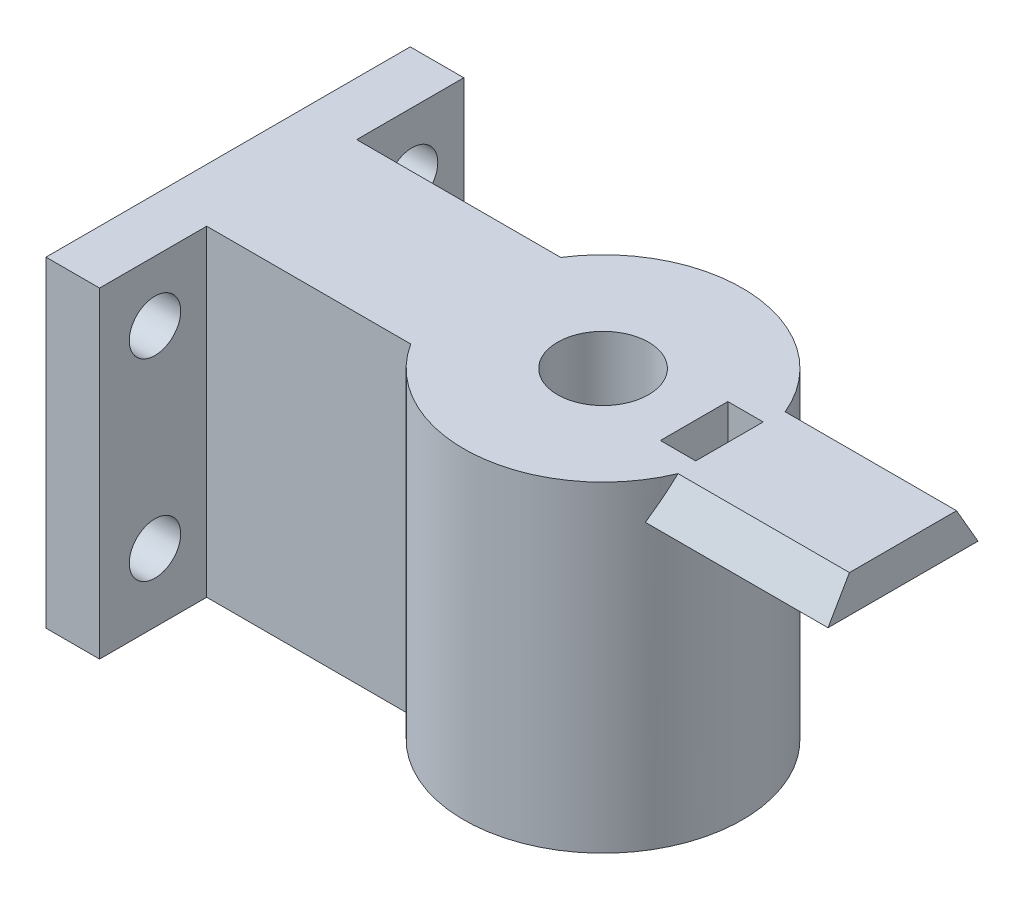
ISO-10303-21;
HEADER;
FILE_DESCRIPTION(('STEP AP214'),'2;1');
FILE_NAME('part.step','',(''),(''),'','','');
FILE_SCHEMA(('AUTOMOTIVE_DESIGN { 1 0 10303 214 1 1 1 1 }'));
ENDSEC;
DATA;
#1=APPLICATION_CONTEXT('core data for automotive mechanical design processes');
#2=APPLICATION_PROTOCOL_DEFINITION('international standard','automotive_design',2000,#1);
#3=PRODUCT_CONTEXT('',#1,'mechanical');
#4=PRODUCT('Part','Part','',(#3));
#5=PRODUCT_RELATED_PRODUCT_CATEGORY('part','',(#4));
#6=PRODUCT_DEFINITION_FORMATION('','',#4);
#7=PRODUCT_DEFINITION_CONTEXT('part definition',#1,'design');
#8=PRODUCT_DEFINITION('design','',#6,#7);
#9=PRODUCT_DEFINITION_SHAPE('','',#8);
#10=(LENGTH_UNIT() NAMED_UNIT(*) SI_UNIT(.MILLI.,.METRE.));
#11=(NAMED_UNIT(*) PLANE_ANGLE_UNIT() SI_UNIT($,.RADIAN.));
#12=(NAMED_UNIT(*) SI_UNIT($,.STERADIAN.) SOLID_ANGLE_UNIT());
#13=UNCERTAINTY_MEASURE_WITH_UNIT(LENGTH_MEASURE(1.E-05),#10,'distance_accuracy_value','');
#14=(GEOMETRIC_REPRESENTATION_CONTEXT(3) GLOBAL_UNCERTAINTY_ASSIGNED_CONTEXT((#13)) GLOBAL_UNIT_ASSIGNED_CONTEXT((#10,
#11,#12)) REPRESENTATION_CONTEXT('',''));
#15=CARTESIAN_POINT('',(0.,0.,0.));
#16=DIRECTION('',(0.,0.,1.));
#17=DIRECTION('',(1.,0.,0.));
#18=AXIS2_PLACEMENT_3D('',#15,#16,#17);
#19=CARTESIAN_POINT('',(35.,30.,0.));
#20=DIRECTION('',(0.,-1.,0.));
#21=DIRECTION('',(0.,0.,-1.));
#22=AXIS2_PLACEMENT_3D('',#19,#20,#21);
#23=PLANE('',#22);
#24=CARTESIAN_POINT('',(35.,30.,0.));
#25=DIRECTION('',(0.,1.,0.));
#26=DIRECTION('',(0.,0.,1.));
#27=AXIS2_PLACEMENT_3D('',#24,#25,#26);
#28=CIRCLE('',#27,4.25000000000001);
#29=CARTESIAN_POINT('',(35.,30.,4.24999999999999));
#30=VERTEX_POINT('',#29);
#31=EDGE_CURVE('E269',#30,#30,#28,.T.);
#32=ORIENTED_EDGE('',*,*,#31,.F.);
#33=EDGE_LOOP('',(#32));
#34=FACE_BOUND('',#33,.T.);
#35=DIRECTION('',(-1.,0.,0.));
#36=VECTOR('',#35,1.);
#37=CARTESIAN_POINT('',(4.99999999999999,30.,-17.));
#38=LINE('',#37,#36);
#39=CARTESIAN_POINT('',(4.99999999999999,30.,-17.));
#40=VERTEX_POINT('',#39);
#41=CARTESIAN_POINT('',(0.,30.,-17.));
#42=VERTEX_POINT('',#41);
#43=EDGE_CURVE('E275',#40,#42,#38,.T.);
#44=ORIENTED_EDGE('',*,*,#43,.T.);
#45=DIRECTION('',(0.,0.,1.));
#46=VECTOR('',#45,1.);
#47=CARTESIAN_POINT('',(0.,30.,-17.));
#48=LINE('',#47,#46);
#49=CARTESIAN_POINT('',(0.,30.,17.));
#50=VERTEX_POINT('',#49);
#51=EDGE_CURVE('E278',#42,#50,#48,.T.);
#52=ORIENTED_EDGE('',*,*,#51,.T.);
#53=DIRECTION('',(1.,0.,0.));
#54=VECTOR('',#53,1.);
#55=CARTESIAN_POINT('',(0.,30.,17.));
#56=LINE('',#55,#54);
#57=CARTESIAN_POINT('',(5.,30.,17.));
#58=VERTEX_POINT('',#57);
#59=EDGE_CURVE('E281',#50,#58,#56,.T.);
#60=ORIENTED_EDGE('',*,*,#59,.T.);
#61=DIRECTION('',(0.,0.,-1.));
#62=VECTOR('',#61,1.);
#63=CARTESIAN_POINT('',(5.,30.,17.));
#64=LINE('',#63,#62);
#65=CARTESIAN_POINT('',(5.,30.,7.));
#66=VERTEX_POINT('',#65);
#67=EDGE_CURVE('E283',#58,#66,#64,.T.);
#68=ORIENTED_EDGE('',*,*,#67,.T.);
#69=DIRECTION('',(1.,0.,0.));
#70=VECTOR('',#69,1.);
#71=CARTESIAN_POINT('',(5.,30.,7.));
#72=LINE('',#71,#70);
#73=CARTESIAN_POINT('',(24.0455488498967,30.,7.));
#74=VERTEX_POINT('',#73);
#75=EDGE_CURVE('E285',#66,#74,#72,.T.);
#76=ORIENTED_EDGE('',*,*,#75,.T.);
#77=CARTESIAN_POINT('',(35.,30.,0.));
#78=DIRECTION('',(0.,1.,0.));
#79=DIRECTION('',(0.,0.,-1.));
#80=AXIS2_PLACEMENT_3D('',#77,#78,#79);
#81=CIRCLE('',#80,13.);
#82=CARTESIAN_POINT('',(47.,30.,5.));
#83=VERTEX_POINT('',#82);
#84=EDGE_CURVE('E288',#74,#83,#81,.T.);
#85=ORIENTED_EDGE('',*,*,#84,.T.);
#86=DIRECTION('',(-1.,0.,0.));
#87=VECTOR('',#86,1.);
#88=CARTESIAN_POINT('',(63.,30.,5.));
#89=LINE('',#88,#87);
#90=CARTESIAN_POINT('',(63.,30.,5.));
#91=VERTEX_POINT('',#90);
#92=EDGE_CURVE('E200',#91,#83,#89,.T.);
#93=ORIENTED_EDGE('',*,*,#92,.F.);
#94=DIRECTION('',(0.,0.,1.));
#95=VECTOR('',#94,1.);
#96=CARTESIAN_POINT('',(63.,30.,5.));
#97=LINE('',#96,#95);
#98=CARTESIAN_POINT('',(63.,30.,-5.));
#99=VERTEX_POINT('',#98);
#100=EDGE_CURVE('E198',#99,#91,#97,.T.);
#101=ORIENTED_EDGE('',*,*,#100,.F.);
#102=DIRECTION('',(-1.,0.,0.));
#103=VECTOR('',#102,1.);
#104=CARTESIAN_POINT('',(63.,30.,-5.));
#105=LINE('',#104,#103);
#106=CARTESIAN_POINT('',(47.,30.,-5.));
#107=VERTEX_POINT('',#106);
#108=EDGE_CURVE('E202',#99,#107,#105,.T.);
#109=ORIENTED_EDGE('',*,*,#108,.T.);
#110=CARTESIAN_POINT('',(24.0455488498967,30.,-7.00000000000002));
#111=VERTEX_POINT('',#110);
#112=EDGE_CURVE('E287',#107,#111,#81,.T.);
#113=ORIENTED_EDGE('',*,*,#112,.T.);
#114=DIRECTION('',(-1.,0.,0.));
#115=VECTOR('',#114,1.);
#116=CARTESIAN_POINT('',(24.0455488498967,30.,-7.00000000000001));
#117=LINE('',#116,#115);
#118=CARTESIAN_POINT('',(5.,30.,-7.));
#119=VERTEX_POINT('',#118);
#120=EDGE_CURVE('E291',#111,#119,#117,.T.);
#121=ORIENTED_EDGE('',*,*,#120,.T.);
#122=DIRECTION('',(0.,0.,-1.));
#123=VECTOR('',#122,1.);
#124=CARTESIAN_POINT('',(5.,30.,-7.));
#125=LINE('',#124,#123);
#126=EDGE_CURVE('E293',#119,#40,#125,.T.);
#127=ORIENTED_EDGE('',*,*,#126,.T.);
#128=EDGE_LOOP('',(#44,#52,#60,#68,#76,#85,#93,#101,#109,#113,#121,#127));
#129=FACE_BOUND('',#128,.T.);
#130=DIRECTION('',(0.,0.,1.));
#131=VECTOR('',#130,1.);
#132=CARTESIAN_POINT('',(43.5,30.,0.));
#133=LINE('',#132,#131);
#134=CARTESIAN_POINT('',(43.5,30.,-3.15));
#135=VERTEX_POINT('',#134);
#136=CARTESIAN_POINT('',(43.5,30.,3.15));
#137=VERTEX_POINT('',#136);
#138=EDGE_CURVE('E12',#135,#137,#133,.T.);
#139=ORIENTED_EDGE('',*,*,#138,.F.);
#140=DIRECTION('',(1.,0.,0.));
#141=VECTOR('',#140,1.);
#142=CARTESIAN_POINT('',(35.,30.,-3.15));
#143=LINE('',#142,#141);
#144=CARTESIAN_POINT('',(46.8,30.,-3.15));
#145=VERTEX_POINT('',#144);
#146=EDGE_CURVE('E49',#135,#145,#143,.T.);
#147=ORIENTED_EDGE('',*,*,#146,.T.);
#148=DIRECTION('',(0.,0.,1.));
#149=VECTOR('',#148,1.);
#150=CARTESIAN_POINT('',(46.8,30.,0.));
#151=LINE('',#150,#149);
#152=CARTESIAN_POINT('',(46.8,30.,3.15));
#153=VERTEX_POINT('',#152);
#154=EDGE_CURVE('E334',#145,#153,#151,.T.);
#155=ORIENTED_EDGE('',*,*,#154,.T.);
#156=DIRECTION('',(-1.,0.,0.));
#157=VECTOR('',#156,1.);
#158=CARTESIAN_POINT('',(35.,30.,3.15));
#159=LINE('',#158,#157);
#160=EDGE_CURVE('E337',#153,#137,#159,.T.);
#161=ORIENTED_EDGE('',*,*,#160,.T.);
#162=EDGE_LOOP('',(#139,#147,#155,#161));
#163=FACE_BOUND('',#162,.T.);
#164=ADVANCED_FACE('F41',(#34,#129,#163),#23,.F.);
#165=CARTESIAN_POINT('',(35.,30.,0.));
#166=DIRECTION('',(0.,-1.,0.));
#167=DIRECTION('',(0.,0.,-1.));
#168=AXIS2_PLACEMENT_3D('',#165,#166,#167);
#169=CYLINDRICAL_SURFACE('',#168,13.);
#170=CARTESIAN_POINT('',(35.,38.6602540378445,0.));
#171=DIRECTION('',(0.,0.499999999999998,0.86602540378444));
#172=DIRECTION('',(0.,-0.86602540378444,0.499999999999998));
#173=AXIS2_PLACEMENT_3D('',#170,#171,#172);
#174=ELLIPSE('',#173,26.0000000000001,13.);
#175=CARTESIAN_POINT('',(45.9544511501033,26.5358983848622,7.));
#176=VERTEX_POINT('',#175);
#177=EDGE_CURVE('E186',#83,#176,#174,.F.);
#178=ORIENTED_EDGE('',*,*,#177,.F.);
#179=ORIENTED_EDGE('',*,*,#84,.F.);
#180=DIRECTION('',(0.,-1.,0.));
#181=VECTOR('',#180,1.);
#182=CARTESIAN_POINT('',(24.0455488498967,30.,7.));
#183=LINE('',#182,#181);
#184=CARTESIAN_POINT('',(24.0455488498967,0.,7.));
#185=VERTEX_POINT('',#184);
#186=EDGE_CURVE('E319',#74,#185,#183,.T.);
#187=ORIENTED_EDGE('',*,*,#186,.T.);
#188=CARTESIAN_POINT('',(35.,0.,0.));
#189=DIRECTION('',(0.,1.,0.));
#190=DIRECTION('',(0.,0.,-1.));
#191=AXIS2_PLACEMENT_3D('',#188,#189,#190);
#192=CIRCLE('',#191,13.);
#193=CARTESIAN_POINT('',(24.0455488498967,0.,-7.00000000000002));
#194=VERTEX_POINT('',#193);
#195=EDGE_CURVE('E306',#185,#194,#192,.T.);
#196=ORIENTED_EDGE('',*,*,#195,.T.);
#197=DIRECTION('',(0.,-1.,0.));
#198=VECTOR('',#197,1.);
#199=CARTESIAN_POINT('',(24.0455488498967,30.,-7.00000000000002));
#200=LINE('',#199,#198);
#201=EDGE_CURVE('E316',#111,#194,#200,.T.);
#202=ORIENTED_EDGE('',*,*,#201,.F.);
#203=ORIENTED_EDGE('',*,*,#112,.F.);
#204=CARTESIAN_POINT('',(35.,38.6602540378444,0.));
#205=DIRECTION('',(0.,0.499999999999997,-0.86602540378444));
#206=DIRECTION('',(0.,-0.86602540378444,-0.499999999999997));
#207=AXIS2_PLACEMENT_3D('',#204,#205,#206);
#208=ELLIPSE('',#207,26.0000000000001,13.);
#209=CARTESIAN_POINT('',(45.9544511501033,26.5358983848622,-7.));
#210=VERTEX_POINT('',#209);
#211=EDGE_CURVE('E64',#210,#107,#208,.F.);
#212=ORIENTED_EDGE('',*,*,#211,.F.);
#213=CARTESIAN_POINT('',(35.,26.5358983848622,0.));
#214=DIRECTION('',(0.,-1.,0.));
#215=DIRECTION('',(0.,0.,-1.));
#216=AXIS2_PLACEMENT_3D('',#213,#214,#215);
#217=CIRCLE('',#216,13.);
#218=EDGE_CURVE('E185',#176,#210,#217,.F.);
#219=ORIENTED_EDGE('',*,*,#218,.F.);
#220=EDGE_LOOP('',(#178,#179,#187,#196,#202,#203,#212,#219));
#221=FACE_BOUND('',#220,.T.);
#222=ADVANCED_FACE('F354',(#221),#169,.T.);
#223=CARTESIAN_POINT('',(35.,30.,0.));
#224=DIRECTION('',(0.,-1.,0.));
#225=DIRECTION('',(0.,0.,-1.));
#226=AXIS2_PLACEMENT_3D('',#223,#224,#225);
#227=CYLINDRICAL_SURFACE('',#226,4.25000000000001);
#228=ORIENTED_EDGE('',*,*,#31,.T.);
#229=EDGE_LOOP('',(#228));
#230=FACE_BOUND('',#229,.T.);
#231=CARTESIAN_POINT('',(35.,15.6,0.));
#232=DIRECTION('',(0.,-1.,0.));
#233=DIRECTION('',(0.,0.,-1.));
#234=AXIS2_PLACEMENT_3D('',#231,#232,#233);
#235=CIRCLE('',#234,4.25000000000001);
#236=CARTESIAN_POINT('',(35.,15.6,-4.25000000000002));
#237=VERTEX_POINT('',#236);
#238=EDGE_CURVE('E254',#237,#237,#235,.T.);
#239=ORIENTED_EDGE('',*,*,#238,.T.);
#240=EDGE_LOOP('',(#239));
#241=FACE_BOUND('',#240,.T.);
#242=ADVANCED_FACE('F360',(#230,#241),#227,.F.);
#243=CARTESIAN_POINT('',(35.,0.,0.));
#244=DIRECTION('',(0.,-1.,0.));
#245=DIRECTION('',(0.,0.,-1.));
#246=AXIS2_PLACEMENT_3D('',#243,#244,#245);
#247=PLANE('',#246);
#248=CARTESIAN_POINT('',(35.,0.,0.));
#249=DIRECTION('',(0.,-1.,0.));
#250=DIRECTION('',(0.,0.,-1.));
#251=AXIS2_PLACEMENT_3D('',#248,#249,#250);
#252=CIRCLE('',#251,11.25);
#253=CARTESIAN_POINT('',(35.,0.,-11.25));
#254=VERTEX_POINT('',#253);
#255=EDGE_CURVE('E263',#254,#254,#252,.T.);
#256=ORIENTED_EDGE('',*,*,#255,.F.);
#257=EDGE_LOOP('',(#256));
#258=FACE_BOUND('',#257,.T.);
#259=DIRECTION('',(-1.,0.,0.));
#260=VECTOR('',#259,1.);
#261=CARTESIAN_POINT('',(4.99999999999999,0.,-17.));
#262=LINE('',#261,#260);
#263=CARTESIAN_POINT('',(4.99999999999999,0.,-17.));
#264=VERTEX_POINT('',#263);
#265=CARTESIAN_POINT('',(0.,0.,-17.));
#266=VERTEX_POINT('',#265);
#267=EDGE_CURVE('E274',#264,#266,#262,.T.);
#268=ORIENTED_EDGE('',*,*,#267,.F.);
#269=DIRECTION('',(0.,0.,-1.));
#270=VECTOR('',#269,1.);
#271=CARTESIAN_POINT('',(5.,0.,-7.));
#272=LINE('',#271,#270);
#273=CARTESIAN_POINT('',(5.,0.,-7.));
#274=VERTEX_POINT('',#273);
#275=EDGE_CURVE('E279',#274,#264,#272,.T.);
#276=ORIENTED_EDGE('',*,*,#275,.F.);
#277=DIRECTION('',(-1.,0.,0.));
#278=VECTOR('',#277,1.);
#279=CARTESIAN_POINT('',(24.0455488498967,0.,-7.00000000000001));
#280=LINE('',#279,#278);
#281=EDGE_CURVE('E308',#194,#274,#280,.T.);
#282=ORIENTED_EDGE('',*,*,#281,.F.);
#283=ORIENTED_EDGE('',*,*,#195,.F.);
#284=DIRECTION('',(1.,0.,0.));
#285=VECTOR('',#284,1.);
#286=CARTESIAN_POINT('',(5.,0.,7.));
#287=LINE('',#286,#285);
#288=CARTESIAN_POINT('',(5.,0.,7.));
#289=VERTEX_POINT('',#288);
#290=EDGE_CURVE('E304',#289,#185,#287,.T.);
#291=ORIENTED_EDGE('',*,*,#290,.F.);
#292=DIRECTION('',(0.,0.,-1.));
#293=VECTOR('',#292,1.);
#294=CARTESIAN_POINT('',(5.,0.,17.));
#295=LINE('',#294,#293);
#296=CARTESIAN_POINT('',(5.,0.,17.));
#297=VERTEX_POINT('',#296);
#298=EDGE_CURVE('E302',#297,#289,#295,.T.);
#299=ORIENTED_EDGE('',*,*,#298,.F.);
#300=DIRECTION('',(1.,0.,0.));
#301=VECTOR('',#300,1.);
#302=CARTESIAN_POINT('',(0.,0.,17.));
#303=LINE('',#302,#301);
#304=CARTESIAN_POINT('',(0.,0.,17.));
#305=VERTEX_POINT('',#304);
#306=EDGE_CURVE('E300',#305,#297,#303,.T.);
#307=ORIENTED_EDGE('',*,*,#306,.F.);
#308=DIRECTION('',(0.,0.,1.));
#309=VECTOR('',#308,1.);
#310=CARTESIAN_POINT('',(0.,0.,-17.));
#311=LINE('',#310,#309);
#312=EDGE_CURVE('E298',#266,#305,#311,.T.);
#313=ORIENTED_EDGE('',*,*,#312,.F.);
#314=EDGE_LOOP('',(#268,#276,#282,#283,#291,#299,#307,#313));
#315=FACE_BOUND('',#314,.T.);
#316=ADVANCED_FACE('F368',(#258,#315),#247,.T.);
#317=CARTESIAN_POINT('',(4.99999999999999,30.,-17.));
#318=DIRECTION('',(0.,0.,1.));
#319=DIRECTION('',(1.,0.,0.));
#320=AXIS2_PLACEMENT_3D('',#317,#318,#319);
#321=PLANE('',#320);
#322=ORIENTED_EDGE('',*,*,#267,.T.);
#323=DIRECTION('',(0.,-1.,0.));
#324=VECTOR('',#323,1.);
#325=CARTESIAN_POINT('',(0.,30.,-17.));
#326=LINE('',#325,#324);
#327=EDGE_CURVE('E331',#42,#266,#326,.T.);
#328=ORIENTED_EDGE('',*,*,#327,.F.);
#329=ORIENTED_EDGE('',*,*,#43,.F.);
#330=DIRECTION('',(0.,-1.,0.));
#331=VECTOR('',#330,1.);
#332=CARTESIAN_POINT('',(4.99999999999999,30.,-17.));
#333=LINE('',#332,#331);
#334=EDGE_CURVE('E295',#40,#264,#333,.T.);
#335=ORIENTED_EDGE('',*,*,#334,.T.);
#336=EDGE_LOOP('',(#322,#328,#329,#335));
#337=FACE_BOUND('',#336,.T.);
#338=ADVANCED_FACE('F43',(#337),#321,.F.);
#339=CARTESIAN_POINT('',(0.,30.,-17.));
#340=DIRECTION('',(1.,0.,0.));
#341=DIRECTION('',(0.,0.,-1.));
#342=AXIS2_PLACEMENT_3D('',#339,#340,#341);
#343=PLANE('',#342);
#344=CARTESIAN_POINT('',(0.,24.3634390627818,11.8281321203426));
#345=DIRECTION('',(1.,0.,0.));
#346=DIRECTION('',(0.,0.,-1.));
#347=AXIS2_PLACEMENT_3D('',#344,#345,#346);
#348=CIRCLE('',#347,2.4);
#349=CARTESIAN_POINT('',(0.,24.3634390627818,9.42813212034262));
#350=VERTEX_POINT('',#349);
#351=EDGE_CURVE('E246',#350,#350,#348,.T.);
#352=ORIENTED_EDGE('',*,*,#351,.T.);
#353=EDGE_LOOP('',(#352));
#354=FACE_BOUND('',#353,.T.);
#355=CARTESIAN_POINT('',(0.,6.36343906278182,11.8281321203426));
#356=DIRECTION('',(1.,0.,0.));
#357=DIRECTION('',(0.,0.,-1.));
#358=AXIS2_PLACEMENT_3D('',#355,#356,#357);
#359=CIRCLE('',#358,2.4);
#360=CARTESIAN_POINT('',(0.,6.36343906278182,9.42813212034262));
#361=VERTEX_POINT('',#360);
#362=EDGE_CURVE('E240',#361,#361,#359,.T.);
#363=ORIENTED_EDGE('',*,*,#362,.T.);
#364=EDGE_LOOP('',(#363));
#365=FACE_BOUND('',#364,.T.);
#366=CARTESIAN_POINT('',(0.,6.36343906278182,-12.1718678796574));
#367=DIRECTION('',(1.,0.,0.));
#368=DIRECTION('',(0.,0.,-1.));
#369=AXIS2_PLACEMENT_3D('',#366,#367,#368);
#370=CIRCLE('',#369,2.4);
#371=CARTESIAN_POINT('',(0.,6.36343906278182,-14.5718678796574));
#372=VERTEX_POINT('',#371);
#373=EDGE_CURVE('E233',#372,#372,#370,.T.);
#374=ORIENTED_EDGE('',*,*,#373,.T.);
#375=EDGE_LOOP('',(#374));
#376=FACE_BOUND('',#375,.T.);
#377=CARTESIAN_POINT('',(0.,24.3634390627818,-12.1718678796574));
#378=DIRECTION('',(1.,0.,0.));
#379=DIRECTION('',(0.,0.,-1.));
#380=AXIS2_PLACEMENT_3D('',#377,#378,#379);
#381=CIRCLE('',#380,2.4);
#382=CARTESIAN_POINT('',(0.,24.3634390627818,-14.5718678796574));
#383=VERTEX_POINT('',#382);
#384=EDGE_CURVE('E251',#383,#383,#381,.T.);
#385=ORIENTED_EDGE('',*,*,#384,.T.);
#386=EDGE_LOOP('',(#385));
#387=FACE_BOUND('',#386,.T.);
#388=ORIENTED_EDGE('',*,*,#312,.T.);
#389=DIRECTION('',(0.,-1.,0.));
#390=VECTOR('',#389,1.);
#391=CARTESIAN_POINT('',(0.,30.,17.));
#392=LINE('',#391,#390);
#393=EDGE_CURVE('E328',#50,#305,#392,.T.);
#394=ORIENTED_EDGE('',*,*,#393,.F.);
#395=ORIENTED_EDGE('',*,*,#51,.F.);
#396=ORIENTED_EDGE('',*,*,#327,.T.);
#397=EDGE_LOOP('',(#388,#394,#395,#396));
#398=FACE_BOUND('',#397,.T.);
#399=ADVANCED_FACE('F391',(#354,#365,#376,#387,#398),#343,.F.);
#400=CARTESIAN_POINT('',(0.,30.,17.));
#401=DIRECTION('',(0.,0.,-1.));
#402=DIRECTION('',(-1.,0.,0.));
#403=AXIS2_PLACEMENT_3D('',#400,#401,#402);
#404=PLANE('',#403);
#405=ORIENTED_EDGE('',*,*,#306,.T.);
#406=DIRECTION('',(0.,-1.,0.));
#407=VECTOR('',#406,1.);
#408=CARTESIAN_POINT('',(5.,30.,17.));
#409=LINE('',#408,#407);
#410=EDGE_CURVE('E325',#58,#297,#409,.T.);
#411=ORIENTED_EDGE('',*,*,#410,.F.);
#412=ORIENTED_EDGE('',*,*,#59,.F.);
#413=ORIENTED_EDGE('',*,*,#393,.T.);
#414=EDGE_LOOP('',(#405,#411,#412,#413));
#415=FACE_BOUND('',#414,.T.);
#416=ADVANCED_FACE('F388',(#415),#404,.F.);
#417=CARTESIAN_POINT('',(5.,30.,17.));
#418=DIRECTION('',(-1.,0.,0.));
#419=DIRECTION('',(0.,0.,1.));
#420=AXIS2_PLACEMENT_3D('',#417,#418,#419);
#421=PLANE('',#420);
#422=CARTESIAN_POINT('',(5.00000000000001,24.3634390627818,11.8281321203426));
#423=DIRECTION('',(1.,0.,0.));
#424=DIRECTION('',(0.,0.,-1.));
#425=AXIS2_PLACEMENT_3D('',#422,#423,#424);
#426=CIRCLE('',#425,2.4);
#427=CARTESIAN_POINT('',(5.00000000000001,24.3634390627818,9.42813212034261));
#428=VERTEX_POINT('',#427);
#429=EDGE_CURVE('E224',#428,#428,#426,.T.);
#430=ORIENTED_EDGE('',*,*,#429,.F.);
#431=EDGE_LOOP('',(#430));
#432=FACE_BOUND('',#431,.T.);
#433=CARTESIAN_POINT('',(5.00000000000001,6.36343906278182,11.8281321203426));
#434=DIRECTION('',(1.,0.,0.));
#435=DIRECTION('',(0.,0.,-1.));
#436=AXIS2_PLACEMENT_3D('',#433,#434,#435);
#437=CIRCLE('',#436,2.4);
#438=CARTESIAN_POINT('',(5.00000000000001,6.36343906278182,9.42813212034261));
#439=VERTEX_POINT('',#438);
#440=EDGE_CURVE('E243',#439,#439,#437,.T.);
#441=ORIENTED_EDGE('',*,*,#440,.F.);
#442=EDGE_LOOP('',(#441));
#443=FACE_BOUND('',#442,.T.);
#444=ORIENTED_EDGE('',*,*,#298,.T.);
#445=DIRECTION('',(0.,-1.,0.));
#446=VECTOR('',#445,1.);
#447=CARTESIAN_POINT('',(5.,30.,7.));
#448=LINE('',#447,#446);
#449=EDGE_CURVE('E322',#66,#289,#448,.T.);
#450=ORIENTED_EDGE('',*,*,#449,.F.);
#451=ORIENTED_EDGE('',*,*,#67,.F.);
#452=ORIENTED_EDGE('',*,*,#410,.T.);
#453=EDGE_LOOP('',(#444,#450,#451,#452));
#454=FACE_BOUND('',#453,.T.);
#455=ADVANCED_FACE('F384',(#432,#443,#454),#421,.F.);
#456=CARTESIAN_POINT('',(5.,30.,7.));
#457=DIRECTION('',(0.,0.,-1.));
#458=DIRECTION('',(-1.,0.,0.));
#459=AXIS2_PLACEMENT_3D('',#456,#457,#458);
#460=PLANE('',#459);
#461=ORIENTED_EDGE('',*,*,#290,.T.);
#462=ORIENTED_EDGE('',*,*,#186,.F.);
#463=ORIENTED_EDGE('',*,*,#75,.F.);
#464=ORIENTED_EDGE('',*,*,#449,.T.);
#465=EDGE_LOOP('',(#461,#462,#463,#464));
#466=FACE_BOUND('',#465,.T.);
#467=ADVANCED_FACE('F379',(#466),#460,.F.);
#468=CARTESIAN_POINT('',(24.0455488498967,30.,-7.00000000000001));
#469=DIRECTION('',(0.,0.,1.));
#470=DIRECTION('',(1.,0.,0.));
#471=AXIS2_PLACEMENT_3D('',#468,#469,#470);
#472=PLANE('',#471);
#473=ORIENTED_EDGE('',*,*,#281,.T.);
#474=DIRECTION('',(0.,-1.,0.));
#475=VECTOR('',#474,1.);
#476=CARTESIAN_POINT('',(5.,30.,-7.));
#477=LINE('',#476,#475);
#478=EDGE_CURVE('E313',#119,#274,#477,.T.);
#479=ORIENTED_EDGE('',*,*,#478,.F.);
#480=ORIENTED_EDGE('',*,*,#120,.F.);
#481=ORIENTED_EDGE('',*,*,#201,.T.);
#482=EDGE_LOOP('',(#473,#479,#480,#481));
#483=FACE_BOUND('',#482,.T.);
#484=ADVANCED_FACE('F376',(#483),#472,.F.);
#485=CARTESIAN_POINT('',(5.,30.,-7.));
#486=DIRECTION('',(-1.,0.,0.));
#487=DIRECTION('',(0.,0.,1.));
#488=AXIS2_PLACEMENT_3D('',#485,#486,#487);
#489=PLANE('',#488);
#490=CARTESIAN_POINT('',(5.,6.36343906278182,-12.1718678796574));
#491=DIRECTION('',(1.,0.,0.));
#492=DIRECTION('',(0.,0.,-1.));
#493=AXIS2_PLACEMENT_3D('',#490,#491,#492);
#494=CIRCLE('',#493,2.4);
#495=CARTESIAN_POINT('',(4.99999999999999,6.36343906278182,-14.5718678796574));
#496=VERTEX_POINT('',#495);
#497=EDGE_CURVE('E237',#496,#496,#494,.T.);
#498=ORIENTED_EDGE('',*,*,#497,.F.);
#499=EDGE_LOOP('',(#498));
#500=FACE_BOUND('',#499,.T.);
#501=CARTESIAN_POINT('',(5.,24.3634390627818,-12.1718678796574));
#502=DIRECTION('',(1.,0.,0.));
#503=DIRECTION('',(0.,0.,-1.));
#504=AXIS2_PLACEMENT_3D('',#501,#502,#503);
#505=CIRCLE('',#504,2.4);
#506=CARTESIAN_POINT('',(4.99999999999999,24.3634390627818,-14.5718678796574));
#507=VERTEX_POINT('',#506);
#508=EDGE_CURVE('E236',#507,#507,#505,.T.);
#509=ORIENTED_EDGE('',*,*,#508,.F.);
#510=EDGE_LOOP('',(#509));
#511=FACE_BOUND('',#510,.T.);
#512=ORIENTED_EDGE('',*,*,#275,.T.);
#513=ORIENTED_EDGE('',*,*,#334,.F.);
#514=ORIENTED_EDGE('',*,*,#126,.F.);
#515=ORIENTED_EDGE('',*,*,#478,.T.);
#516=EDGE_LOOP('',(#512,#513,#514,#515));
#517=FACE_BOUND('',#516,.T.);
#518=ADVANCED_FACE('F372',(#500,#511,#517),#489,.F.);
#519=CARTESIAN_POINT('',(35.,5.,0.));
#520=DIRECTION('',(0.,-1.,0.));
#521=DIRECTION('',(0.,0.,-1.));
#522=AXIS2_PLACEMENT_3D('',#519,#520,#521);
#523=CYLINDRICAL_SURFACE('',#522,11.25);
#524=CARTESIAN_POINT('',(35.,5.,0.));
#525=DIRECTION('',(0.,-1.,0.));
#526=DIRECTION('',(0.,0.,-1.));
#527=AXIS2_PLACEMENT_3D('',#524,#525,#526);
#528=CIRCLE('',#527,11.25);
#529=CARTESIAN_POINT('',(35.,5.,-11.25));
#530=VERTEX_POINT('',#529);
#531=EDGE_CURVE('E266',#530,#530,#528,.T.);
#532=ORIENTED_EDGE('',*,*,#531,.F.);
#533=EDGE_LOOP('',(#532));
#534=FACE_BOUND('',#533,.T.);
#535=ORIENTED_EDGE('',*,*,#255,.T.);
#536=EDGE_LOOP('',(#535));
#537=FACE_BOUND('',#536,.T.);
#538=ADVANCED_FACE('F375',(#534,#537),#523,.F.);
#539=CARTESIAN_POINT('',(0.,5.,0.));
#540=DIRECTION('',(0.,-1.,0.));
#541=DIRECTION('',(0.,0.,-1.));
#542=AXIS2_PLACEMENT_3D('',#539,#540,#541);
#543=PLANE('',#542);
#544=CARTESIAN_POINT('',(43.,5.,0.));
#545=DIRECTION('',(0.,-1.,0.));
#546=DIRECTION('',(0.,0.,-1.));
#547=AXIS2_PLACEMENT_3D('',#544,#545,#546);
#548=CIRCLE('',#547,1.3);
#549=CARTESIAN_POINT('',(43.,5.,-1.3));
#550=VERTEX_POINT('',#549);
#551=EDGE_CURVE('E208',#550,#550,#548,.T.);
#552=ORIENTED_EDGE('',*,*,#551,.F.);
#553=EDGE_LOOP('',(#552));
#554=FACE_BOUND('',#553,.T.);
#555=CARTESIAN_POINT('',(27.,5.,0.));
#556=DIRECTION('',(0.,-1.,0.));
#557=DIRECTION('',(0.,0.,-1.));
#558=AXIS2_PLACEMENT_3D('',#555,#556,#557);
#559=CIRCLE('',#558,1.3);
#560=CARTESIAN_POINT('',(27.,5.,-1.3));
#561=VERTEX_POINT('',#560);
#562=EDGE_CURVE('E212',#561,#561,#559,.T.);
#563=ORIENTED_EDGE('',*,*,#562,.F.);
#564=EDGE_LOOP('',(#563));
#565=FACE_BOUND('',#564,.T.);
#566=CARTESIAN_POINT('',(35.,5.,7.99999999999999));
#567=DIRECTION('',(0.,-1.,0.));
#568=DIRECTION('',(0.,0.,-1.));
#569=AXIS2_PLACEMENT_3D('',#566,#567,#568);
#570=CIRCLE('',#569,1.3);
#571=CARTESIAN_POINT('',(35.,5.,6.69999999999999));
#572=VERTEX_POINT('',#571);
#573=EDGE_CURVE('E225',#572,#572,#570,.T.);
#574=ORIENTED_EDGE('',*,*,#573,.F.);
#575=EDGE_LOOP('',(#574));
#576=FACE_BOUND('',#575,.T.);
#577=CARTESIAN_POINT('',(35.,5.,-8.00000000000001));
#578=DIRECTION('',(0.,-1.,0.));
#579=DIRECTION('',(0.,0.,-1.));
#580=AXIS2_PLACEMENT_3D('',#577,#578,#579);
#581=CIRCLE('',#580,1.3);
#582=CARTESIAN_POINT('',(35.,5.,-9.30000000000001));
#583=VERTEX_POINT('',#582);
#584=EDGE_CURVE('E218',#583,#583,#581,.T.);
#585=ORIENTED_EDGE('',*,*,#584,.F.);
#586=EDGE_LOOP('',(#585));
#587=FACE_BOUND('',#586,.T.);
#588=CARTESIAN_POINT('',(35.,5.,0.));
#589=DIRECTION('',(0.,-1.,0.));
#590=DIRECTION('',(0.,0.,-1.));
#591=AXIS2_PLACEMENT_3D('',#588,#589,#590);
#592=CIRCLE('',#591,5.25);
#593=CARTESIAN_POINT('',(35.,5.,-5.25000000000001));
#594=VERTEX_POINT('',#593);
#595=EDGE_CURVE('E259',#594,#594,#592,.T.);
#596=ORIENTED_EDGE('',*,*,#595,.F.);
#597=EDGE_LOOP('',(#596));
#598=FACE_BOUND('',#597,.T.);
#599=ORIENTED_EDGE('',*,*,#531,.T.);
#600=EDGE_LOOP('',(#599));
#601=FACE_BOUND('',#600,.T.);
#602=ADVANCED_FACE('F515',(#554,#565,#576,#587,#598,#601),#543,.T.);
#603=CARTESIAN_POINT('',(35.,15.6,0.));
#604=DIRECTION('',(0.,-1.,0.));
#605=DIRECTION('',(0.,0.,-1.));
#606=AXIS2_PLACEMENT_3D('',#603,#604,#605);
#607=CYLINDRICAL_SURFACE('',#606,5.25);
#608=CARTESIAN_POINT('',(35.,15.6,0.));
#609=DIRECTION('',(0.,-1.,0.));
#610=DIRECTION('',(0.,0.,-1.));
#611=AXIS2_PLACEMENT_3D('',#608,#609,#610);
#612=CIRCLE('',#611,5.25);
#613=CARTESIAN_POINT('',(35.,15.6,-5.25000000000001));
#614=VERTEX_POINT('',#613);
#615=EDGE_CURVE('E260',#614,#614,#612,.T.);
#616=ORIENTED_EDGE('',*,*,#615,.F.);
#617=EDGE_LOOP('',(#616));
#618=FACE_BOUND('',#617,.T.);
#619=ORIENTED_EDGE('',*,*,#595,.T.);
#620=EDGE_LOOP('',(#619));
#621=FACE_BOUND('',#620,.T.);
#622=ADVANCED_FACE('F511',(#618,#621),#607,.F.);
#623=CARTESIAN_POINT('',(35.,15.6,0.));
#624=DIRECTION('',(0.,-1.,0.));
#625=DIRECTION('',(0.,0.,-1.));
#626=AXIS2_PLACEMENT_3D('',#623,#624,#625);
#627=PLANE('',#626);
#628=ORIENTED_EDGE('',*,*,#238,.F.);
#629=EDGE_LOOP('',(#628));
#630=FACE_BOUND('',#629,.T.);
#631=ORIENTED_EDGE('',*,*,#615,.T.);
#632=EDGE_LOOP('',(#631));
#633=FACE_BOUND('',#632,.T.);
#634=ADVANCED_FACE('F507',(#630,#633),#627,.T.);
#635=CARTESIAN_POINT('',(0.,24.3634390627818,-12.1718678796574));
#636=DIRECTION('',(1.,0.,0.));
#637=DIRECTION('',(0.,0.,-1.));
#638=AXIS2_PLACEMENT_3D('',#635,#636,#637);
#639=CYLINDRICAL_SURFACE('',#638,2.4);
#640=ORIENTED_EDGE('',*,*,#384,.F.);
#641=EDGE_LOOP('',(#640));
#642=FACE_BOUND('',#641,.T.);
#643=ORIENTED_EDGE('',*,*,#508,.T.);
#644=EDGE_LOOP('',(#643));
#645=FACE_BOUND('',#644,.T.);
#646=ADVANCED_FACE('F497',(#642,#645),#639,.F.);
#647=CARTESIAN_POINT('',(0.,6.36343906278182,-12.1718678796574));
#648=DIRECTION('',(1.,0.,0.));
#649=DIRECTION('',(0.,0.,-1.));
#650=AXIS2_PLACEMENT_3D('',#647,#648,#649);
#651=CYLINDRICAL_SURFACE('',#650,2.4);
#652=ORIENTED_EDGE('',*,*,#373,.F.);
#653=EDGE_LOOP('',(#652));
#654=FACE_BOUND('',#653,.T.);
#655=ORIENTED_EDGE('',*,*,#497,.T.);
#656=EDGE_LOOP('',(#655));
#657=FACE_BOUND('',#656,.T.);
#658=ADVANCED_FACE('F493',(#654,#657),#651,.F.);
#659=CARTESIAN_POINT('',(0.,6.36343906278182,11.8281321203426));
#660=DIRECTION('',(1.,0.,0.));
#661=DIRECTION('',(0.,0.,-1.));
#662=AXIS2_PLACEMENT_3D('',#659,#660,#661);
#663=CYLINDRICAL_SURFACE('',#662,2.4);
#664=ORIENTED_EDGE('',*,*,#362,.F.);
#665=EDGE_LOOP('',(#664));
#666=FACE_BOUND('',#665,.T.);
#667=ORIENTED_EDGE('',*,*,#440,.T.);
#668=EDGE_LOOP('',(#667));
#669=FACE_BOUND('',#668,.T.);
#670=ADVANCED_FACE('F496',(#666,#669),#663,.F.);
#671=CARTESIAN_POINT('',(0.,24.3634390627818,11.8281321203426));
#672=DIRECTION('',(1.,0.,0.));
#673=DIRECTION('',(0.,0.,-1.));
#674=AXIS2_PLACEMENT_3D('',#671,#672,#673);
#675=CYLINDRICAL_SURFACE('',#674,2.4);
#676=ORIENTED_EDGE('',*,*,#351,.F.);
#677=EDGE_LOOP('',(#676));
#678=FACE_BOUND('',#677,.T.);
#679=ORIENTED_EDGE('',*,*,#429,.T.);
#680=EDGE_LOOP('',(#679));
#681=FACE_BOUND('',#680,.T.);
#682=ADVANCED_FACE('F491',(#678,#681),#675,.F.);
#683=CARTESIAN_POINT('',(35.,11.,-8.00000000000001));
#684=DIRECTION('',(0.,-1.,0.));
#685=DIRECTION('',(0.,0.,-1.));
#686=AXIS2_PLACEMENT_3D('',#683,#684,#685);
#687=CYLINDRICAL_SURFACE('',#686,1.3);
#688=CARTESIAN_POINT('',(35.,11.,-8.00000000000001));
#689=DIRECTION('',(0.,-1.,0.));
#690=DIRECTION('',(0.,0.,-1.));
#691=AXIS2_PLACEMENT_3D('',#688,#689,#690);
#692=CIRCLE('',#691,1.3);
#693=CARTESIAN_POINT('',(35.,11.,-9.30000000000001));
#694=VERTEX_POINT('',#693);
#695=EDGE_CURVE('E228',#694,#694,#692,.T.);
#696=ORIENTED_EDGE('',*,*,#695,.F.);
#697=EDGE_LOOP('',(#696));
#698=FACE_BOUND('',#697,.T.);
#699=ORIENTED_EDGE('',*,*,#584,.T.);
#700=EDGE_LOOP('',(#699));
#701=FACE_BOUND('',#700,.T.);
#702=ADVANCED_FACE('F487',(#698,#701),#687,.F.);
#703=CARTESIAN_POINT('',(0.,11.,0.));
#704=DIRECTION('',(0.,-1.,0.));
#705=DIRECTION('',(0.,0.,-1.));
#706=AXIS2_PLACEMENT_3D('',#703,#704,#705);
#707=PLANE('',#706);
#708=ORIENTED_EDGE('',*,*,#695,.T.);
#709=EDGE_LOOP('',(#708));
#710=FACE_BOUND('',#709,.T.);
#711=ADVANCED_FACE('F483',(#710),#707,.T.);
#712=CARTESIAN_POINT('',(35.,11.,7.99999999999999));
#713=DIRECTION('',(0.,-1.,0.));
#714=DIRECTION('',(0.,0.,-1.));
#715=AXIS2_PLACEMENT_3D('',#712,#713,#714);
#716=CYLINDRICAL_SURFACE('',#715,1.3);
#717=CARTESIAN_POINT('',(35.,11.,7.99999999999999));
#718=DIRECTION('',(0.,-1.,0.));
#719=DIRECTION('',(0.,0.,-1.));
#720=AXIS2_PLACEMENT_3D('',#717,#718,#719);
#721=CIRCLE('',#720,1.3);
#722=CARTESIAN_POINT('',(35.,11.,6.69999999999999));
#723=VERTEX_POINT('',#722);
#724=EDGE_CURVE('E221',#723,#723,#721,.T.);
#725=ORIENTED_EDGE('',*,*,#724,.F.);
#726=EDGE_LOOP('',(#725));
#727=FACE_BOUND('',#726,.T.);
#728=ORIENTED_EDGE('',*,*,#573,.T.);
#729=EDGE_LOOP('',(#728));
#730=FACE_BOUND('',#729,.T.);
#731=ADVANCED_FACE('F479',(#727,#730),#716,.F.);
#732=CARTESIAN_POINT('',(0.,11.,0.));
#733=DIRECTION('',(0.,-1.,0.));
#734=DIRECTION('',(0.,0.,-1.));
#735=AXIS2_PLACEMENT_3D('',#732,#733,#734);
#736=PLANE('',#735);
#737=ORIENTED_EDGE('',*,*,#724,.T.);
#738=EDGE_LOOP('',(#737));
#739=FACE_BOUND('',#738,.T.);
#740=ADVANCED_FACE('F475',(#739),#736,.T.);
#741=CARTESIAN_POINT('',(27.,1.4,0.));
#742=DIRECTION('',(0.,1.,0.));
#743=DIRECTION('',(0.,0.,1.));
#744=AXIS2_PLACEMENT_3D('',#741,#742,#743);
#745=CYLINDRICAL_SURFACE('',#744,1.3);
#746=CARTESIAN_POINT('',(27.,1.4,0.));
#747=DIRECTION('',(0.,-1.,0.));
#748=DIRECTION('',(0.,0.,-1.));
#749=AXIS2_PLACEMENT_3D('',#746,#747,#748);
#750=CIRCLE('',#749,1.3);
#751=CARTESIAN_POINT('',(27.,1.4,-1.3));
#752=VERTEX_POINT('',#751);
#753=EDGE_CURVE('E215',#752,#752,#750,.T.);
#754=ORIENTED_EDGE('',*,*,#753,.F.);
#755=EDGE_LOOP('',(#754));
#756=FACE_BOUND('',#755,.T.);
#757=ORIENTED_EDGE('',*,*,#562,.T.);
#758=EDGE_LOOP('',(#757));
#759=FACE_BOUND('',#758,.T.);
#760=ADVANCED_FACE('F471',(#756,#759),#745,.T.);
#761=CARTESIAN_POINT('',(0.,1.4,0.));
#762=DIRECTION('',(0.,-1.,0.));
#763=DIRECTION('',(0.,0.,-1.));
#764=AXIS2_PLACEMENT_3D('',#761,#762,#763);
#765=PLANE('',#764);
#766=ORIENTED_EDGE('',*,*,#753,.T.);
#767=EDGE_LOOP('',(#766));
#768=FACE_BOUND('',#767,.T.);
#769=ADVANCED_FACE('F467',(#768),#765,.T.);
#770=CARTESIAN_POINT('',(43.,1.4,0.));
#771=DIRECTION('',(0.,1.,0.));
#772=DIRECTION('',(0.,0.,1.));
#773=AXIS2_PLACEMENT_3D('',#770,#771,#772);
#774=CYLINDRICAL_SURFACE('',#773,1.3);
#775=CARTESIAN_POINT('',(43.,1.4,0.));
#776=DIRECTION('',(0.,-1.,0.));
#777=DIRECTION('',(0.,0.,-1.));
#778=AXIS2_PLACEMENT_3D('',#775,#776,#777);
#779=CIRCLE('',#778,1.3);
#780=CARTESIAN_POINT('',(43.,1.4,-1.3));
#781=VERTEX_POINT('',#780);
#782=EDGE_CURVE('E209',#781,#781,#779,.T.);
#783=ORIENTED_EDGE('',*,*,#782,.F.);
#784=EDGE_LOOP('',(#783));
#785=FACE_BOUND('',#784,.T.);
#786=ORIENTED_EDGE('',*,*,#551,.T.);
#787=EDGE_LOOP('',(#786));
#788=FACE_BOUND('',#787,.T.);
#789=ADVANCED_FACE('F463',(#785,#788),#774,.T.);
#790=CARTESIAN_POINT('',(0.,1.4,0.));
#791=DIRECTION('',(0.,-1.,0.));
#792=DIRECTION('',(0.,0.,-1.));
#793=AXIS2_PLACEMENT_3D('',#790,#791,#792);
#794=PLANE('',#793);
#795=ORIENTED_EDGE('',*,*,#782,.T.);
#796=EDGE_LOOP('',(#795));
#797=FACE_BOUND('',#796,.T.);
#798=ADVANCED_FACE('F460',(#797),#794,.T.);
#799=CARTESIAN_POINT('',(63.,26.5358983848622,7.));
#800=DIRECTION('',(0.,-0.499999999999998,-0.86602540378444));
#801=DIRECTION('',(0.,0.86602540378444,-0.499999999999998));
#802=AXIS2_PLACEMENT_3D('',#799,#800,#801);
#803=PLANE('',#802);
#804=ORIENTED_EDGE('',*,*,#92,.T.);
#805=ORIENTED_EDGE('',*,*,#177,.T.);
#806=DIRECTION('',(-1.,0.,0.));
#807=VECTOR('',#806,1.);
#808=CARTESIAN_POINT('',(63.,26.5358983848622,7.));
#809=LINE('',#808,#807);
#810=CARTESIAN_POINT('',(63.,26.5358983848622,7.));
#811=VERTEX_POINT('',#810);
#812=EDGE_CURVE('E206',#811,#176,#809,.T.);
#813=ORIENTED_EDGE('',*,*,#812,.F.);
#814=DIRECTION('',(0.,-0.86602540378444,0.499999999999998));
#815=VECTOR('',#814,1.);
#816=CARTESIAN_POINT('',(63.,26.5358983848622,7.));
#817=LINE('',#816,#815);
#818=EDGE_CURVE('E189',#91,#811,#817,.T.);
#819=ORIENTED_EDGE('',*,*,#818,.F.);
#820=EDGE_LOOP('',(#804,#805,#813,#819));
#821=FACE_BOUND('',#820,.T.);
#822=ADVANCED_FACE('F438',(#821),#803,.F.);
#823=CARTESIAN_POINT('',(63.,26.5358983848622,-7.));
#824=DIRECTION('',(0.,1.,0.));
#825=DIRECTION('',(0.,0.,1.));
#826=AXIS2_PLACEMENT_3D('',#823,#824,#825);
#827=PLANE('',#826);
#828=ORIENTED_EDGE('',*,*,#812,.T.);
#829=ORIENTED_EDGE('',*,*,#218,.T.);
#830=DIRECTION('',(-1.,0.,0.));
#831=VECTOR('',#830,1.);
#832=CARTESIAN_POINT('',(63.,26.5358983848622,-7.));
#833=LINE('',#832,#831);
#834=CARTESIAN_POINT('',(63.,26.5358983848622,-7.));
#835=VERTEX_POINT('',#834);
#836=EDGE_CURVE('E204',#835,#210,#833,.T.);
#837=ORIENTED_EDGE('',*,*,#836,.F.);
#838=DIRECTION('',(0.,0.,-1.));
#839=VECTOR('',#838,1.);
#840=CARTESIAN_POINT('',(63.,26.5358983848622,-7.));
#841=LINE('',#840,#839);
#842=EDGE_CURVE('E194',#811,#835,#841,.T.);
#843=ORIENTED_EDGE('',*,*,#842,.F.);
#844=EDGE_LOOP('',(#828,#829,#837,#843));
#845=FACE_BOUND('',#844,.T.);
#846=ADVANCED_FACE('F447',(#845),#827,.F.);
#847=CARTESIAN_POINT('',(63.,30.,-5.));
#848=DIRECTION('',(0.,-0.499999999999997,0.86602540378444));
#849=DIRECTION('',(0.,-0.86602540378444,-0.499999999999997));
#850=AXIS2_PLACEMENT_3D('',#847,#848,#849);
#851=PLANE('',#850);
#852=ORIENTED_EDGE('',*,*,#836,.T.);
#853=ORIENTED_EDGE('',*,*,#211,.T.);
#854=ORIENTED_EDGE('',*,*,#108,.F.);
#855=DIRECTION('',(0.,0.86602540378444,0.499999999999998));
#856=VECTOR('',#855,1.);
#857=CARTESIAN_POINT('',(63.,30.,-5.));
#858=LINE('',#857,#856);
#859=EDGE_CURVE('E196',#835,#99,#858,.T.);
#860=ORIENTED_EDGE('',*,*,#859,.F.);
#861=EDGE_LOOP('',(#852,#853,#854,#860));
#862=FACE_BOUND('',#861,.T.);
#863=ADVANCED_FACE('F445',(#862),#851,.F.);
#864=CARTESIAN_POINT('',(63.,0.,0.));
#865=DIRECTION('',(-1.,0.,0.));
#866=DIRECTION('',(0.,0.,1.));
#867=AXIS2_PLACEMENT_3D('',#864,#865,#866);
#868=PLANE('',#867);
#869=ORIENTED_EDGE('',*,*,#818,.T.);
#870=ORIENTED_EDGE('',*,*,#842,.T.);
#871=ORIENTED_EDGE('',*,*,#859,.T.);
#872=ORIENTED_EDGE('',*,*,#100,.T.);
#873=EDGE_LOOP('',(#869,#870,#871,#872));
#874=FACE_BOUND('',#873,.T.);
#875=ADVANCED_FACE('F442',(#874),#868,.F.);
#876=CARTESIAN_POINT('',(43.5,30.4729892789372,-3.15));
#877=DIRECTION('',(0.,0.,-1.));
#878=DIRECTION('',(0.,1.,0.));
#879=AXIS2_PLACEMENT_3D('',#876,#877,#878);
#880=PLANE('',#879);
#881=DIRECTION('',(0.,1.,0.));
#882=VECTOR('',#881,1.);
#883=CARTESIAN_POINT('',(43.5,30.4729892789372,-3.15));
#884=LINE('',#883,#882);
#885=CARTESIAN_POINT('',(43.5,9.53589838486223,-3.15));
#886=VERTEX_POINT('',#885);
#887=EDGE_CURVE('E172',#886,#135,#884,.T.);
#888=ORIENTED_EDGE('',*,*,#887,.F.);
#889=DIRECTION('',(1.,0.,0.));
#890=VECTOR('',#889,1.);
#891=CARTESIAN_POINT('',(43.5,9.53589838486223,-3.15));
#892=LINE('',#891,#890);
#893=CARTESIAN_POINT('',(46.8,9.53589838486223,-3.15));
#894=VERTEX_POINT('',#893);
#895=EDGE_CURVE('E171',#886,#894,#892,.T.);
#896=ORIENTED_EDGE('',*,*,#895,.T.);
#897=DIRECTION('',(0.,1.,0.));
#898=VECTOR('',#897,1.);
#899=CARTESIAN_POINT('',(46.8,30.4729892789372,-3.15));
#900=LINE('',#899,#898);
#901=EDGE_CURVE('E164',#894,#145,#900,.T.);
#902=ORIENTED_EDGE('',*,*,#901,.T.);
#903=ORIENTED_EDGE('',*,*,#146,.F.);
#904=EDGE_LOOP('',(#888,#896,#902,#903));
#905=FACE_BOUND('',#904,.T.);
#906=ADVANCED_FACE('F341',(#905),#880,.F.);
#907=CARTESIAN_POINT('',(43.5,30.4729892789372,3.15));
#908=DIRECTION('',(0.,0.,1.));
#909=DIRECTION('',(0.,-1.,0.));
#910=AXIS2_PLACEMENT_3D('',#907,#908,#909);
#911=PLANE('',#910);
#912=DIRECTION('',(0.,-1.,0.));
#913=VECTOR('',#912,1.);
#914=CARTESIAN_POINT('',(46.8,30.4729892789372,3.15));
#915=LINE('',#914,#913);
#916=CARTESIAN_POINT('',(46.8,9.53589838486223,3.15));
#917=VERTEX_POINT('',#916);
#918=EDGE_CURVE('E56',#153,#917,#915,.T.);
#919=ORIENTED_EDGE('',*,*,#918,.T.);
#920=DIRECTION('',(1.,0.,0.));
#921=VECTOR('',#920,1.);
#922=CARTESIAN_POINT('',(43.5,9.53589838486223,3.15));
#923=LINE('',#922,#921);
#924=CARTESIAN_POINT('',(43.5,9.53589838486223,3.15));
#925=VERTEX_POINT('',#924);
#926=EDGE_CURVE('E167',#925,#917,#923,.T.);
#927=ORIENTED_EDGE('',*,*,#926,.F.);
#928=DIRECTION('',(0.,-1.,0.));
#929=VECTOR('',#928,1.);
#930=CARTESIAN_POINT('',(43.5,30.4729892789372,3.15));
#931=LINE('',#930,#929);
#932=EDGE_CURVE('E154',#137,#925,#931,.T.);
#933=ORIENTED_EDGE('',*,*,#932,.F.);
#934=ORIENTED_EDGE('',*,*,#160,.F.);
#935=EDGE_LOOP('',(#919,#927,#933,#934));
#936=FACE_BOUND('',#935,.T.);
#937=ADVANCED_FACE('F168',(#936),#911,.F.);
#938=CARTESIAN_POINT('',(43.5,30.4729892789372,0.));
#939=DIRECTION('',(1.,0.,0.));
#940=DIRECTION('',(0.,0.,-1.));
#941=AXIS2_PLACEMENT_3D('',#938,#939,#940);
#942=PLANE('',#941);
#943=ORIENTED_EDGE('',*,*,#138,.T.);
#944=ORIENTED_EDGE('',*,*,#932,.T.);
#945=CARTESIAN_POINT('',(43.5,9.53589838486223,0.));
#946=DIRECTION('',(1.,0.,0.));
#947=DIRECTION('',(0.,0.,-1.));
#948=AXIS2_PLACEMENT_3D('',#945,#946,#947);
#949=CIRCLE('',#948,3.15);
#950=EDGE_CURVE('E159',#925,#886,#949,.T.);
#951=ORIENTED_EDGE('',*,*,#950,.T.);
#952=ORIENTED_EDGE('',*,*,#887,.T.);
#953=EDGE_LOOP('',(#943,#944,#951,#952));
#954=FACE_BOUND('',#953,.T.);
#955=ADVANCED_FACE('F156',(#954),#942,.T.);
#956=CARTESIAN_POINT('',(46.8,30.4729892789372,0.));
#957=DIRECTION('',(1.,0.,0.));
#958=DIRECTION('',(0.,0.,-1.));
#959=AXIS2_PLACEMENT_3D('',#956,#957,#958);
#960=PLANE('',#959);
#961=ORIENTED_EDGE('',*,*,#901,.F.);
#962=CARTESIAN_POINT('',(46.8,9.53589838486223,0.));
#963=DIRECTION('',(1.,0.,0.));
#964=DIRECTION('',(0.,0.,-1.));
#965=AXIS2_PLACEMENT_3D('',#962,#963,#964);
#966=CIRCLE('',#965,3.15);
#967=EDGE_CURVE('E179',#917,#894,#966,.T.);
#968=ORIENTED_EDGE('',*,*,#967,.F.);
#969=ORIENTED_EDGE('',*,*,#918,.F.);
#970=ORIENTED_EDGE('',*,*,#154,.F.);
#971=EDGE_LOOP('',(#961,#968,#969,#970));
#972=FACE_BOUND('',#971,.T.);
#973=ADVANCED_FACE('F343',(#972),#960,.F.);
#974=CARTESIAN_POINT('',(43.5,9.53589838486223,0.));
#975=DIRECTION('',(1.,0.,0.));
#976=DIRECTION('',(0.,0.,-1.));
#977=AXIS2_PLACEMENT_3D('',#974,#975,#976);
#978=CYLINDRICAL_SURFACE('',#977,3.15);
#979=ORIENTED_EDGE('',*,*,#967,.T.);
#980=ORIENTED_EDGE('',*,*,#895,.F.);
#981=ORIENTED_EDGE('',*,*,#950,.F.);
#982=ORIENTED_EDGE('',*,*,#926,.T.);
#983=EDGE_LOOP('',(#979,#980,#981,#982));
#984=FACE_BOUND('',#983,.T.);
#985=ADVANCED_FACE('F174',(#984),#978,.F.);
#986=CLOSED_SHELL('',(#164,#222,#242,#316,#338,#399,#416,#455,#467,#484,#518,#538,#602,#622,
#634,#646,#658,#670,#682,#702,#711,#731,#740,#760,#769,#789,#798,#822,#846,#863,#875,#906,#937,
#955,#973,#985));
#987=MANIFOLD_SOLID_BREP('B2',#986);
#988=ADVANCED_BREP_SHAPE_REPRESENTATION('',(#18,#987),#14);
#989=SHAPE_DEFINITION_REPRESENTATION(#9,#988);
ENDSEC;
END-ISO-10303-21;
